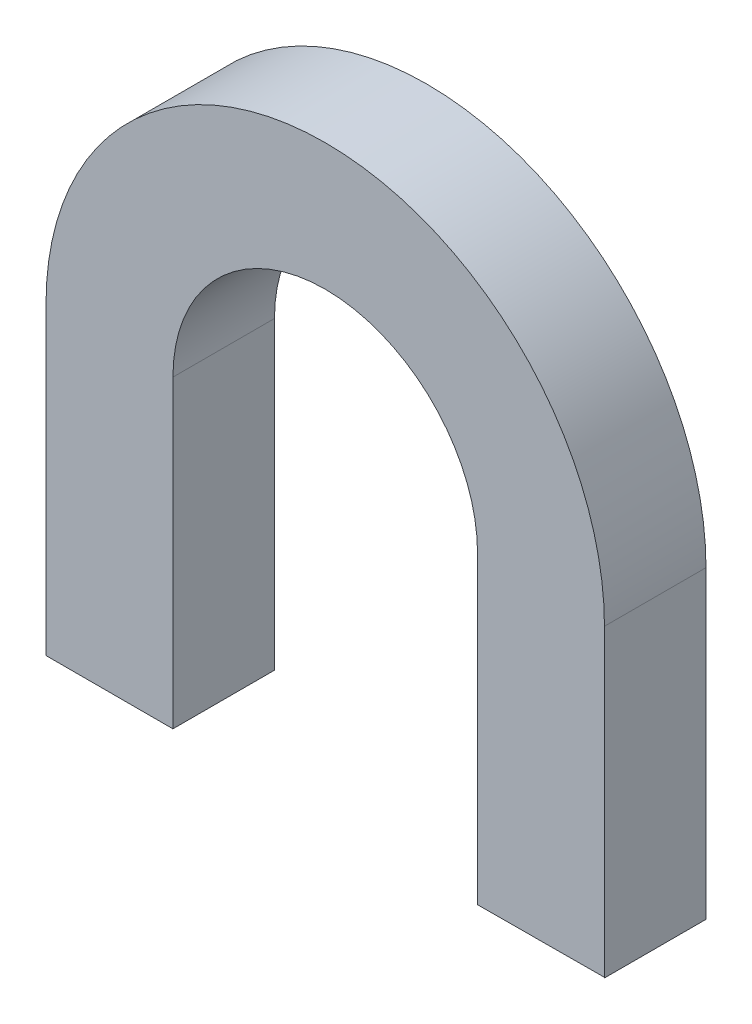
ISO-10303-21;
HEADER;
FILE_DESCRIPTION(('STEP AP214'),'2;1');
FILE_NAME('part.step','',(''),(''),'','','');
FILE_SCHEMA(('AUTOMOTIVE_DESIGN { 1 0 10303 214 1 1 1 1 }'));
ENDSEC;
DATA;
#1=APPLICATION_CONTEXT('core data for automotive mechanical design processes');
#2=APPLICATION_PROTOCOL_DEFINITION('international standard','automotive_design',2000,#1);
#3=PRODUCT_CONTEXT('',#1,'mechanical');
#4=PRODUCT('Part','Part','',(#3));
#5=PRODUCT_RELATED_PRODUCT_CATEGORY('part','',(#4));
#6=PRODUCT_DEFINITION_FORMATION('','',#4);
#7=PRODUCT_DEFINITION_CONTEXT('part definition',#1,'design');
#8=PRODUCT_DEFINITION('design','',#6,#7);
#9=PRODUCT_DEFINITION_SHAPE('','',#8);
#10=(LENGTH_UNIT() NAMED_UNIT(*) SI_UNIT(.MILLI.,.METRE.));
#11=(NAMED_UNIT(*) PLANE_ANGLE_UNIT() SI_UNIT($,.RADIAN.));
#12=(NAMED_UNIT(*) SI_UNIT($,.STERADIAN.) SOLID_ANGLE_UNIT());
#13=UNCERTAINTY_MEASURE_WITH_UNIT(LENGTH_MEASURE(1.E-05),#10,'distance_accuracy_value','');
#14=(GEOMETRIC_REPRESENTATION_CONTEXT(3) GLOBAL_UNCERTAINTY_ASSIGNED_CONTEXT((#13)) GLOBAL_UNIT_ASSIGNED_CONTEXT((#10,
#11,#12)) REPRESENTATION_CONTEXT('',''));
#15=CARTESIAN_POINT('',(0.,0.,0.));
#16=DIRECTION('',(0.,0.,1.));
#17=DIRECTION('',(1.,0.,0.));
#18=AXIS2_PLACEMENT_3D('',#15,#16,#17);
#19=CARTESIAN_POINT('',(-42.4118638538747,35.1875343232959,4.));
#20=DIRECTION('',(1.,0.,0.));
#21=DIRECTION('',(0.,0.,-1.));
#22=AXIS2_PLACEMENT_3D('',#19,#20,#21);
#23=PLANE('',#22);
#24=DIRECTION('',(0.,-1.,0.));
#25=VECTOR('',#24,1.);
#26=CARTESIAN_POINT('',(-42.4118638538747,35.1875343232959,0.));
#27=LINE('',#26,#25);
#28=CARTESIAN_POINT('',(-42.4118638538747,35.1875343232959,0.));
#29=VERTEX_POINT('',#28);
#30=CARTESIAN_POINT('',(-42.4118638538747,23.1875343232959,0.));
#31=VERTEX_POINT('',#30);
#32=EDGE_CURVE('E136',#29,#31,#27,.T.);
#33=ORIENTED_EDGE('',*,*,#32,.T.);
#34=DIRECTION('',(0.,0.,-1.));
#35=VECTOR('',#34,1.);
#36=CARTESIAN_POINT('',(-42.4118638538747,23.1875343232959,4.));
#37=LINE('',#36,#35);
#38=CARTESIAN_POINT('',(-42.4118638538747,23.1875343232959,4.));
#39=VERTEX_POINT('',#38);
#40=EDGE_CURVE('E11',#39,#31,#37,.T.);
#41=ORIENTED_EDGE('',*,*,#40,.F.);
#42=DIRECTION('',(0.,-1.,0.));
#43=VECTOR('',#42,1.);
#44=CARTESIAN_POINT('',(-42.4118638538747,35.1875343232959,4.));
#45=LINE('',#44,#43);
#46=CARTESIAN_POINT('',(-42.4118638538747,35.1875343232959,4.));
#47=VERTEX_POINT('',#46);
#48=EDGE_CURVE('E157',#47,#39,#45,.T.);
#49=ORIENTED_EDGE('',*,*,#48,.F.);
#50=DIRECTION('',(0.,0.,-1.));
#51=VECTOR('',#50,1.);
#52=CARTESIAN_POINT('',(-42.4118638538747,35.1875343232959,4.));
#53=LINE('',#52,#51);
#54=EDGE_CURVE('E49',#47,#29,#53,.T.);
#55=ORIENTED_EDGE('',*,*,#54,.T.);
#56=EDGE_LOOP('',(#33,#41,#49,#55));
#57=FACE_BOUND('',#56,.T.);
#58=ADVANCED_FACE('F33',(#57),#23,.F.);
#59=CARTESIAN_POINT('',(-42.4118638538747,23.1875343232959,4.));
#60=DIRECTION('',(-0.00437642502695725,0.999990423406136,0.));
#61=DIRECTION('',(-0.999990423406136,-0.00437642502695725,0.));
#62=AXIS2_PLACEMENT_3D('',#59,#60,#61);
#63=PLANE('',#62);
#64=DIRECTION('',(0.999990423406136,0.00437642502695725,0.));
#65=VECTOR('',#64,1.);
#66=CARTESIAN_POINT('',(-42.4118638538747,23.1875343232959,0.));
#67=LINE('',#66,#65);
#68=CARTESIAN_POINT('',(-37.4406407277102,23.209290716952,0.));
#69=VERTEX_POINT('',#68);
#70=EDGE_CURVE('E138',#31,#69,#67,.T.);
#71=ORIENTED_EDGE('',*,*,#70,.T.);
#72=DIRECTION('',(0.,0.,-1.));
#73=VECTOR('',#72,1.);
#74=CARTESIAN_POINT('',(-37.4406407277102,23.209290716952,4.));
#75=LINE('',#74,#73);
#76=CARTESIAN_POINT('',(-37.4406407277102,23.209290716952,4.));
#77=VERTEX_POINT('',#76);
#78=EDGE_CURVE('E41',#77,#69,#75,.T.);
#79=ORIENTED_EDGE('',*,*,#78,.F.);
#80=DIRECTION('',(0.999990423406136,0.00437642502695725,0.));
#81=VECTOR('',#80,1.);
#82=CARTESIAN_POINT('',(-42.4118638538747,23.1875343232959,4.));
#83=LINE('',#82,#81);
#84=EDGE_CURVE('E90',#39,#77,#83,.T.);
#85=ORIENTED_EDGE('',*,*,#84,.F.);
#86=ORIENTED_EDGE('',*,*,#40,.T.);
#87=EDGE_LOOP('',(#71,#79,#85,#86));
#88=FACE_BOUND('',#87,.T.);
#89=ADVANCED_FACE('F173',(#88),#63,.F.);
#90=CARTESIAN_POINT('',(-37.4118638538747,23.1875343232959,4.));
#91=DIRECTION('',(-0.603077754487208,-0.797682406752629,0.));
#92=DIRECTION('',(0.797682406752629,-0.603077754487208,0.));
#93=AXIS2_PLACEMENT_3D('',#90,#91,#92);
#94=PLANE('',#93);
#95=DIRECTION('',(-0.797682406752629,0.603077754487208,0.));
#96=VECTOR('',#95,1.);
#97=CARTESIAN_POINT('',(-37.4118638538747,23.1875343232959,0.));
#98=LINE('',#97,#96);
#99=CARTESIAN_POINT('',(-37.4118638538747,23.1875343232959,0.));
#100=VERTEX_POINT('',#99);
#101=EDGE_CURVE('E141',#100,#69,#98,.T.);
#102=ORIENTED_EDGE('',*,*,#101,.F.);
#103=DIRECTION('',(0.,0.,-1.));
#104=VECTOR('',#103,1.);
#105=CARTESIAN_POINT('',(-37.4118638538747,23.1875343232959,4.));
#106=LINE('',#105,#104);
#107=CARTESIAN_POINT('',(-37.4118638538747,23.1875343232959,4.));
#108=VERTEX_POINT('',#107);
#109=EDGE_CURVE('E166',#108,#100,#106,.T.);
#110=ORIENTED_EDGE('',*,*,#109,.F.);
#111=DIRECTION('',(-0.797682406752629,0.603077754487208,0.));
#112=VECTOR('',#111,1.);
#113=CARTESIAN_POINT('',(-37.4118638538747,23.1875343232959,4.));
#114=LINE('',#113,#112);
#115=EDGE_CURVE('E172',#108,#77,#114,.T.);
#116=ORIENTED_EDGE('',*,*,#115,.T.);
#117=ORIENTED_EDGE('',*,*,#78,.T.);
#118=EDGE_LOOP('',(#102,#110,#116,#117));
#119=FACE_BOUND('',#118,.T.);
#120=ADVANCED_FACE('F170',(#119),#94,.T.);
#121=CARTESIAN_POINT('',(-37.4118638538747,35.1875343232959,4.));
#122=DIRECTION('',(1.,0.,0.));
#123=DIRECTION('',(0.,0.,-1.));
#124=AXIS2_PLACEMENT_3D('',#121,#122,#123);
#125=PLANE('',#124);
#126=DIRECTION('',(0.,-1.,0.));
#127=VECTOR('',#126,1.);
#128=CARTESIAN_POINT('',(-37.4118638538747,35.1875343232959,0.));
#129=LINE('',#128,#127);
#130=CARTESIAN_POINT('',(-37.4118638538747,35.1875343232959,0.));
#131=VERTEX_POINT('',#130);
#132=EDGE_CURVE('E144',#131,#100,#129,.T.);
#133=ORIENTED_EDGE('',*,*,#132,.F.);
#134=DIRECTION('',(0.,0.,-1.));
#135=VECTOR('',#134,1.);
#136=CARTESIAN_POINT('',(-37.4118638538747,35.1875343232959,4.));
#137=LINE('',#136,#135);
#138=CARTESIAN_POINT('',(-37.4118638538747,35.1875343232959,4.));
#139=VERTEX_POINT('',#138);
#140=EDGE_CURVE('E164',#139,#131,#137,.T.);
#141=ORIENTED_EDGE('',*,*,#140,.F.);
#142=DIRECTION('',(0.,-1.,0.));
#143=VECTOR('',#142,1.);
#144=CARTESIAN_POINT('',(-37.4118638538747,35.1875343232959,4.));
#145=LINE('',#144,#143);
#146=EDGE_CURVE('E185',#139,#108,#145,.T.);
#147=ORIENTED_EDGE('',*,*,#146,.T.);
#148=ORIENTED_EDGE('',*,*,#109,.T.);
#149=EDGE_LOOP('',(#133,#141,#147,#148));
#150=FACE_BOUND('',#149,.T.);
#151=ADVANCED_FACE('F181',(#150),#125,.T.);
#152=CARTESIAN_POINT('',(-48.4118638538747,35.1875343232959,4.));
#153=DIRECTION('',(0.,0.,-1.));
#154=DIRECTION('',(-1.,0.,0.));
#155=AXIS2_PLACEMENT_3D('',#152,#153,#154);
#156=CYLINDRICAL_SURFACE('',#155,11.);
#157=CARTESIAN_POINT('',(-48.4118638538747,35.1875343232959,0.));
#158=DIRECTION('',(0.,0.,1.));
#159=DIRECTION('',(1.,0.,0.));
#160=AXIS2_PLACEMENT_3D('',#157,#158,#159);
#161=CIRCLE('',#160,11.);
#162=CARTESIAN_POINT('',(-59.4118638538748,35.1875343232959,0.));
#163=VERTEX_POINT('',#162);
#164=EDGE_CURVE('E147',#131,#163,#161,.T.);
#165=ORIENTED_EDGE('',*,*,#164,.T.);
#166=DIRECTION('',(0.,0.,-1.));
#167=VECTOR('',#166,1.);
#168=CARTESIAN_POINT('',(-59.4118638538748,35.1875343232959,4.));
#169=LINE('',#168,#167);
#170=CARTESIAN_POINT('',(-59.4118638538748,35.1875343232959,4.));
#171=VERTEX_POINT('',#170);
#172=EDGE_CURVE('E161',#171,#163,#169,.T.);
#173=ORIENTED_EDGE('',*,*,#172,.F.);
#174=CARTESIAN_POINT('',(-48.4118638538747,35.1875343232959,4.));
#175=DIRECTION('',(0.,0.,1.));
#176=DIRECTION('',(1.,0.,0.));
#177=AXIS2_PLACEMENT_3D('',#174,#175,#176);
#178=CIRCLE('',#177,11.);
#179=EDGE_CURVE('E187',#139,#171,#178,.T.);
#180=ORIENTED_EDGE('',*,*,#179,.F.);
#181=ORIENTED_EDGE('',*,*,#140,.T.);
#182=EDGE_LOOP('',(#165,#173,#180,#181));
#183=FACE_BOUND('',#182,.T.);
#184=ADVANCED_FACE('F194',(#183),#156,.T.);
#185=CARTESIAN_POINT('',(-59.4118638538748,35.1875343232959,4.));
#186=DIRECTION('',(1.,0.,0.));
#187=DIRECTION('',(0.,1.,0.));
#188=AXIS2_PLACEMENT_3D('',#185,#186,#187);
#189=PLANE('',#188);
#190=DIRECTION('',(0.,-1.,0.));
#191=VECTOR('',#190,1.);
#192=CARTESIAN_POINT('',(-59.4118638538748,35.1875343232959,0.));
#193=LINE('',#192,#191);
#194=CARTESIAN_POINT('',(-59.4118638538747,23.1875343232959,0.));
#195=VERTEX_POINT('',#194);
#196=EDGE_CURVE('E149',#163,#195,#193,.T.);
#197=ORIENTED_EDGE('',*,*,#196,.T.);
#198=DIRECTION('',(0.,0.,-1.));
#199=VECTOR('',#198,1.);
#200=CARTESIAN_POINT('',(-59.4118638538747,23.1875343232959,4.));
#201=LINE('',#200,#199);
#202=CARTESIAN_POINT('',(-59.4118638538747,23.1875343232959,4.));
#203=VERTEX_POINT('',#202);
#204=EDGE_CURVE('E128',#203,#195,#201,.T.);
#205=ORIENTED_EDGE('',*,*,#204,.F.);
#206=DIRECTION('',(0.,-1.,0.));
#207=VECTOR('',#206,1.);
#208=CARTESIAN_POINT('',(-59.4118638538748,35.1875343232959,4.));
#209=LINE('',#208,#207);
#210=EDGE_CURVE('E116',#171,#203,#209,.T.);
#211=ORIENTED_EDGE('',*,*,#210,.F.);
#212=ORIENTED_EDGE('',*,*,#172,.T.);
#213=EDGE_LOOP('',(#197,#205,#211,#212));
#214=FACE_BOUND('',#213,.T.);
#215=ADVANCED_FACE('F196',(#214),#189,.F.);
#216=CARTESIAN_POINT('',(-59.4118638538747,23.1875343232959,4.));
#217=DIRECTION('',(0.,1.,0.));
#218=DIRECTION('',(0.,0.,1.));
#219=AXIS2_PLACEMENT_3D('',#216,#217,#218);
#220=PLANE('',#219);
#221=DIRECTION('',(1.,0.,0.));
#222=VECTOR('',#221,1.);
#223=CARTESIAN_POINT('',(-59.4118638538747,23.1875343232959,0.));
#224=LINE('',#223,#222);
#225=CARTESIAN_POINT('',(-54.4118638538748,23.1875343232959,0.));
#226=VERTEX_POINT('',#225);
#227=EDGE_CURVE('E125',#195,#226,#224,.T.);
#228=ORIENTED_EDGE('',*,*,#227,.T.);
#229=DIRECTION('',(0.,0.,-1.));
#230=VECTOR('',#229,1.);
#231=CARTESIAN_POINT('',(-54.4118638538748,23.1875343232959,4.));
#232=LINE('',#231,#230);
#233=CARTESIAN_POINT('',(-54.4118638538748,23.1875343232959,4.));
#234=VERTEX_POINT('',#233);
#235=EDGE_CURVE('E122',#234,#226,#232,.T.);
#236=ORIENTED_EDGE('',*,*,#235,.F.);
#237=DIRECTION('',(1.,0.,0.));
#238=VECTOR('',#237,1.);
#239=CARTESIAN_POINT('',(-59.4118638538747,23.1875343232959,4.));
#240=LINE('',#239,#238);
#241=EDGE_CURVE('E109',#203,#234,#240,.T.);
#242=ORIENTED_EDGE('',*,*,#241,.F.);
#243=ORIENTED_EDGE('',*,*,#204,.T.);
#244=EDGE_LOOP('',(#228,#236,#242,#243));
#245=FACE_BOUND('',#244,.T.);
#246=ADVANCED_FACE('F123',(#245),#220,.F.);
#247=CARTESIAN_POINT('',(-54.4118638538748,35.1875343232959,4.));
#248=DIRECTION('',(1.,0.,0.));
#249=DIRECTION('',(0.,0.,-1.));
#250=AXIS2_PLACEMENT_3D('',#247,#248,#249);
#251=PLANE('',#250);
#252=DIRECTION('',(0.,-1.,0.));
#253=VECTOR('',#252,1.);
#254=CARTESIAN_POINT('',(-54.4118638538748,35.1875343232959,0.));
#255=LINE('',#254,#253);
#256=CARTESIAN_POINT('',(-54.4118638538748,35.1875343232959,0.));
#257=VERTEX_POINT('',#256);
#258=EDGE_CURVE('E152',#257,#226,#255,.T.);
#259=ORIENTED_EDGE('',*,*,#258,.F.);
#260=DIRECTION('',(0.,0.,-1.));
#261=VECTOR('',#260,1.);
#262=CARTESIAN_POINT('',(-54.4118638538748,35.1875343232959,4.));
#263=LINE('',#262,#261);
#264=CARTESIAN_POINT('',(-54.4118638538748,35.1875343232959,4.));
#265=VERTEX_POINT('',#264);
#266=EDGE_CURVE('E78',#265,#257,#263,.T.);
#267=ORIENTED_EDGE('',*,*,#266,.F.);
#268=DIRECTION('',(0.,-1.,0.));
#269=VECTOR('',#268,1.);
#270=CARTESIAN_POINT('',(-54.4118638538748,35.1875343232959,4.));
#271=LINE('',#270,#269);
#272=EDGE_CURVE('E114',#265,#234,#271,.T.);
#273=ORIENTED_EDGE('',*,*,#272,.T.);
#274=ORIENTED_EDGE('',*,*,#235,.T.);
#275=EDGE_LOOP('',(#259,#267,#273,#274));
#276=FACE_BOUND('',#275,.T.);
#277=ADVANCED_FACE('F130',(#276),#251,.T.);
#278=CARTESIAN_POINT('',(-48.4118638538747,35.1875343232959,4.));
#279=DIRECTION('',(0.,0.,-1.));
#280=DIRECTION('',(-1.,0.,0.));
#281=AXIS2_PLACEMENT_3D('',#278,#279,#280);
#282=CYLINDRICAL_SURFACE('',#281,6.00000000000001);
#283=CARTESIAN_POINT('',(-48.4118638538747,35.1875343232959,0.));
#284=DIRECTION('',(0.,0.,1.));
#285=DIRECTION('',(1.,0.,0.));
#286=AXIS2_PLACEMENT_3D('',#283,#284,#285);
#287=CIRCLE('',#286,6.00000000000001);
#288=EDGE_CURVE('E154',#29,#257,#287,.T.);
#289=ORIENTED_EDGE('',*,*,#288,.F.);
#290=ORIENTED_EDGE('',*,*,#54,.F.);
#291=CARTESIAN_POINT('',(-48.4118638538747,35.1875343232959,4.));
#292=DIRECTION('',(0.,0.,1.));
#293=DIRECTION('',(1.,0.,0.));
#294=AXIS2_PLACEMENT_3D('',#291,#292,#293);
#295=CIRCLE('',#294,6.00000000000001);
#296=EDGE_CURVE('E131',#47,#265,#295,.T.);
#297=ORIENTED_EDGE('',*,*,#296,.T.);
#298=ORIENTED_EDGE('',*,*,#266,.T.);
#299=EDGE_LOOP('',(#289,#290,#297,#298));
#300=FACE_BOUND('',#299,.T.);
#301=ADVANCED_FACE('F197',(#300),#282,.F.);
#302=CARTESIAN_POINT('',(-48.4118638538747,35.1875343232959,4.));
#303=DIRECTION('',(0.,0.,1.));
#304=DIRECTION('',(1.,0.,0.));
#305=AXIS2_PLACEMENT_3D('',#302,#303,#304);
#306=PLANE('',#305);
#307=ORIENTED_EDGE('',*,*,#48,.T.);
#308=ORIENTED_EDGE('',*,*,#84,.T.);
#309=ORIENTED_EDGE('',*,*,#115,.F.);
#310=ORIENTED_EDGE('',*,*,#146,.F.);
#311=ORIENTED_EDGE('',*,*,#179,.T.);
#312=ORIENTED_EDGE('',*,*,#210,.T.);
#313=ORIENTED_EDGE('',*,*,#241,.T.);
#314=ORIENTED_EDGE('',*,*,#272,.F.);
#315=ORIENTED_EDGE('',*,*,#296,.F.);
#316=EDGE_LOOP('',(#307,#308,#309,#310,#311,#312,#313,#314,#315));
#317=FACE_BOUND('',#316,.T.);
#318=ADVANCED_FACE('F111',(#317),#306,.T.);
#319=CARTESIAN_POINT('',(-48.4118638538747,35.1875343232959,0.));
#320=DIRECTION('',(0.,0.,1.));
#321=DIRECTION('',(1.,0.,0.));
#322=AXIS2_PLACEMENT_3D('',#319,#320,#321);
#323=PLANE('',#322);
#324=ORIENTED_EDGE('',*,*,#32,.F.);
#325=ORIENTED_EDGE('',*,*,#288,.T.);
#326=ORIENTED_EDGE('',*,*,#258,.T.);
#327=ORIENTED_EDGE('',*,*,#227,.F.);
#328=ORIENTED_EDGE('',*,*,#196,.F.);
#329=ORIENTED_EDGE('',*,*,#164,.F.);
#330=ORIENTED_EDGE('',*,*,#132,.T.);
#331=ORIENTED_EDGE('',*,*,#101,.T.);
#332=ORIENTED_EDGE('',*,*,#70,.F.);
#333=EDGE_LOOP('',(#324,#325,#326,#327,#328,#329,#330,#331,#332));
#334=FACE_BOUND('',#333,.T.);
#335=ADVANCED_FACE('F176',(#334),#323,.F.);
#336=CLOSED_SHELL('',(#58,#89,#120,#151,#184,#215,#246,#277,#301,#318,#335));
#337=MANIFOLD_SOLID_BREP('B2',#336);
#338=ADVANCED_BREP_SHAPE_REPRESENTATION('',(#18,#337),#14);
#339=SHAPE_DEFINITION_REPRESENTATION(#9,#338);
ENDSEC;
END-ISO-10303-21;
